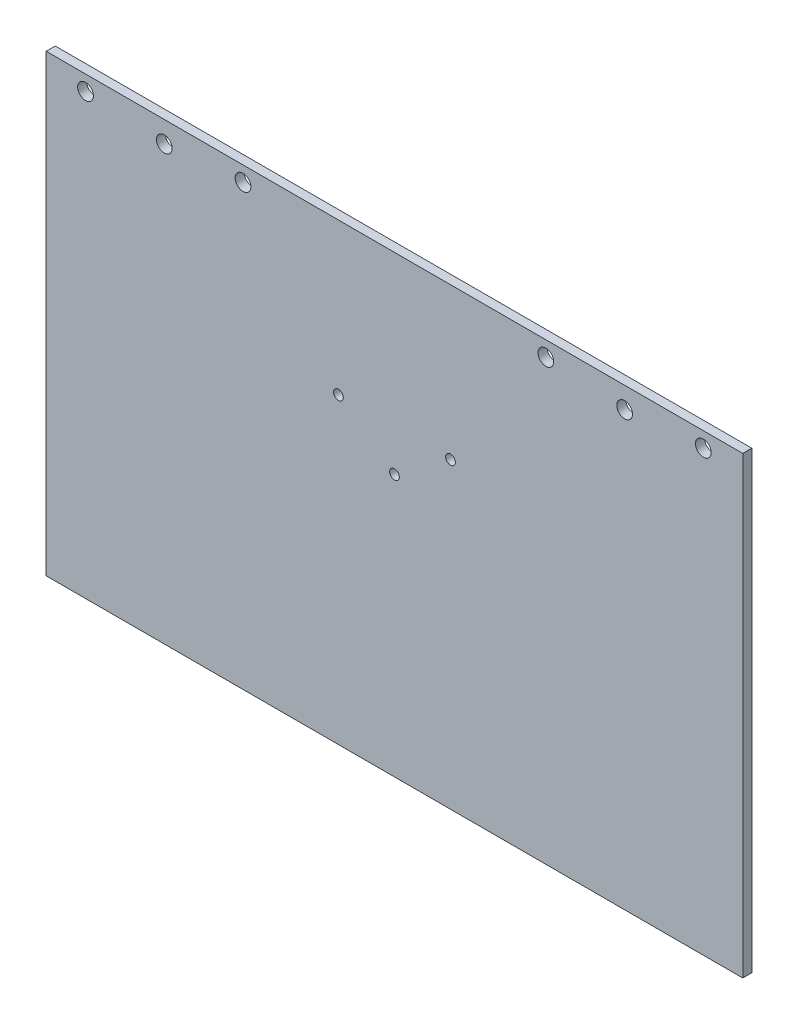
ISO-10303-21;
HEADER;
FILE_DESCRIPTION(('STEP AP214'),'2;1');
FILE_NAME('part.step','',(''),(''),'','','');
FILE_SCHEMA(('AUTOMOTIVE_DESIGN { 1 0 10303 214 1 1 1 1 }'));
ENDSEC;
DATA;
#1=APPLICATION_CONTEXT('core data for automotive mechanical design processes');
#2=APPLICATION_PROTOCOL_DEFINITION('international standard','automotive_design',2000,#1);
#3=PRODUCT_CONTEXT('',#1,'mechanical');
#4=PRODUCT('Part','Part','',(#3));
#5=PRODUCT_RELATED_PRODUCT_CATEGORY('part','',(#4));
#6=PRODUCT_DEFINITION_FORMATION('','',#4);
#7=PRODUCT_DEFINITION_CONTEXT('part definition',#1,'design');
#8=PRODUCT_DEFINITION('design','',#6,#7);
#9=PRODUCT_DEFINITION_SHAPE('','',#8);
#10=(LENGTH_UNIT() NAMED_UNIT(*) SI_UNIT(.MILLI.,.METRE.));
#11=(NAMED_UNIT(*) PLANE_ANGLE_UNIT() SI_UNIT($,.RADIAN.));
#12=(NAMED_UNIT(*) SI_UNIT($,.STERADIAN.) SOLID_ANGLE_UNIT());
#13=UNCERTAINTY_MEASURE_WITH_UNIT(LENGTH_MEASURE(1.E-05),#10,'distance_accuracy_value','');
#14=(GEOMETRIC_REPRESENTATION_CONTEXT(3) GLOBAL_UNCERTAINTY_ASSIGNED_CONTEXT((#13)) GLOBAL_UNIT_ASSIGNED_CONTEXT((#10,
#11,#12)) REPRESENTATION_CONTEXT('',''));
#15=CARTESIAN_POINT('',(0.,0.,0.));
#16=DIRECTION('',(0.,0.,1.));
#17=DIRECTION('',(1.,0.,0.));
#18=AXIS2_PLACEMENT_3D('',#15,#16,#17);
#19=CARTESIAN_POINT('',(-145.,100.,3.));
#20=DIRECTION('',(1.,0.,0.));
#21=DIRECTION('',(0.,1.,0.));
#22=AXIS2_PLACEMENT_3D('',#19,#20,#21);
#23=PLANE('',#22);
#24=DIRECTION('',(0.,-1.,0.));
#25=VECTOR('',#24,1.);
#26=CARTESIAN_POINT('',(-145.,100.,0.));
#27=LINE('',#26,#25);
#28=CARTESIAN_POINT('',(-145.,100.,0.));
#29=VERTEX_POINT('',#28);
#30=CARTESIAN_POINT('',(-145.,-50.,0.));
#31=VERTEX_POINT('',#30);
#32=EDGE_CURVE('E114',#29,#31,#27,.T.);
#33=ORIENTED_EDGE('',*,*,#32,.T.);
#34=DIRECTION('',(0.,0.,-1.));
#35=VECTOR('',#34,1.);
#36=CARTESIAN_POINT('',(-145.,-50.,3.));
#37=LINE('',#36,#35);
#38=CARTESIAN_POINT('',(-145.,-50.,3.));
#39=VERTEX_POINT('',#38);
#40=EDGE_CURVE('E13',#39,#31,#37,.T.);
#41=ORIENTED_EDGE('',*,*,#40,.F.);
#42=DIRECTION('',(0.,-1.,0.));
#43=VECTOR('',#42,1.);
#44=CARTESIAN_POINT('',(-145.,100.,3.));
#45=LINE('',#44,#43);
#46=CARTESIAN_POINT('',(-145.,100.,3.));
#47=VERTEX_POINT('',#46);
#48=EDGE_CURVE('E101',#47,#39,#45,.T.);
#49=ORIENTED_EDGE('',*,*,#48,.F.);
#50=DIRECTION('',(0.,0.,-1.));
#51=VECTOR('',#50,1.);
#52=CARTESIAN_POINT('',(-145.,100.,3.));
#53=LINE('',#52,#51);
#54=EDGE_CURVE('E110',#47,#29,#53,.T.);
#55=ORIENTED_EDGE('',*,*,#54,.T.);
#56=EDGE_LOOP('',(#33,#41,#49,#55));
#57=FACE_BOUND('',#56,.T.);
#58=ADVANCED_FACE('F48',(#57),#23,.F.);
#59=CARTESIAN_POINT('',(85.,-50.,3.));
#60=DIRECTION('',(0.,1.,0.));
#61=DIRECTION('',(-1.,0.,0.));
#62=AXIS2_PLACEMENT_3D('',#59,#60,#61);
#63=PLANE('',#62);
#64=DIRECTION('',(1.,0.,0.));
#65=VECTOR('',#64,1.);
#66=CARTESIAN_POINT('',(85.,-50.,0.));
#67=LINE('',#66,#65);
#68=CARTESIAN_POINT('',(85.,-50.,0.));
#69=VERTEX_POINT('',#68);
#70=EDGE_CURVE('E105',#31,#69,#67,.T.);
#71=ORIENTED_EDGE('',*,*,#70,.T.);
#72=DIRECTION('',(0.,0.,-1.));
#73=VECTOR('',#72,1.);
#74=CARTESIAN_POINT('',(85.,-50.,3.));
#75=LINE('',#74,#73);
#76=CARTESIAN_POINT('',(85.,-50.,3.));
#77=VERTEX_POINT('',#76);
#78=EDGE_CURVE('E57',#77,#69,#75,.T.);
#79=ORIENTED_EDGE('',*,*,#78,.F.);
#80=DIRECTION('',(1.,0.,0.));
#81=VECTOR('',#80,1.);
#82=CARTESIAN_POINT('',(85.,-50.,3.));
#83=LINE('',#82,#81);
#84=EDGE_CURVE('E96',#39,#77,#83,.T.);
#85=ORIENTED_EDGE('',*,*,#84,.F.);
#86=ORIENTED_EDGE('',*,*,#40,.T.);
#87=EDGE_LOOP('',(#71,#79,#85,#86));
#88=FACE_BOUND('',#87,.T.);
#89=ADVANCED_FACE('F104',(#88),#63,.F.);
#90=CARTESIAN_POINT('',(85.,100.,3.));
#91=DIRECTION('',(-1.,0.,0.));
#92=DIRECTION('',(0.,-1.,0.));
#93=AXIS2_PLACEMENT_3D('',#90,#91,#92);
#94=PLANE('',#93);
#95=DIRECTION('',(0.,1.,0.));
#96=VECTOR('',#95,1.);
#97=CARTESIAN_POINT('',(85.,100.,0.));
#98=LINE('',#97,#96);
#99=CARTESIAN_POINT('',(85.,100.,0.));
#100=VERTEX_POINT('',#99);
#101=EDGE_CURVE('E83',#69,#100,#98,.T.);
#102=ORIENTED_EDGE('',*,*,#101,.T.);
#103=DIRECTION('',(0.,0.,-1.));
#104=VECTOR('',#103,1.);
#105=CARTESIAN_POINT('',(85.,100.,3.));
#106=LINE('',#105,#104);
#107=CARTESIAN_POINT('',(85.,100.,3.));
#108=VERTEX_POINT('',#107);
#109=EDGE_CURVE('E106',#108,#100,#106,.T.);
#110=ORIENTED_EDGE('',*,*,#109,.F.);
#111=DIRECTION('',(0.,1.,0.));
#112=VECTOR('',#111,1.);
#113=CARTESIAN_POINT('',(85.,100.,3.));
#114=LINE('',#113,#112);
#115=EDGE_CURVE('E99',#77,#108,#114,.T.);
#116=ORIENTED_EDGE('',*,*,#115,.F.);
#117=ORIENTED_EDGE('',*,*,#78,.T.);
#118=EDGE_LOOP('',(#102,#110,#116,#117));
#119=FACE_BOUND('',#118,.T.);
#120=ADVANCED_FACE('F108',(#119),#94,.F.);
#121=CARTESIAN_POINT('',(-145.,100.,3.));
#122=DIRECTION('',(0.,-1.,0.));
#123=DIRECTION('',(0.,0.,-1.));
#124=AXIS2_PLACEMENT_3D('',#121,#122,#123);
#125=PLANE('',#124);
#126=DIRECTION('',(-1.,0.,0.));
#127=VECTOR('',#126,1.);
#128=CARTESIAN_POINT('',(-145.,100.,0.));
#129=LINE('',#128,#127);
#130=EDGE_CURVE('E89',#100,#29,#129,.T.);
#131=ORIENTED_EDGE('',*,*,#130,.T.);
#132=ORIENTED_EDGE('',*,*,#54,.F.);
#133=DIRECTION('',(-1.,0.,0.));
#134=VECTOR('',#133,1.);
#135=CARTESIAN_POINT('',(-145.,100.,3.));
#136=LINE('',#135,#134);
#137=EDGE_CURVE('E66',#108,#47,#136,.T.);
#138=ORIENTED_EDGE('',*,*,#137,.F.);
#139=ORIENTED_EDGE('',*,*,#109,.T.);
#140=EDGE_LOOP('',(#131,#132,#138,#139));
#141=FACE_BOUND('',#140,.T.);
#142=ADVANCED_FACE('F213',(#141),#125,.F.);
#143=CARTESIAN_POINT('',(0.,0.,3.));
#144=DIRECTION('',(0.,0.,-1.));
#145=DIRECTION('',(-1.,0.,0.));
#146=AXIS2_PLACEMENT_3D('',#143,#144,#145);
#147=PLANE('',#146);
#148=CARTESIAN_POINT('',(-29.9999999999284,36.4999999999856,3.));
#149=DIRECTION('',(0.,0.,1.));
#150=DIRECTION('',(1.,0.,0.));
#151=AXIS2_PLACEMENT_3D('',#148,#149,#150);
#152=CIRCLE('',#151,1.6);
#153=CARTESIAN_POINT('',(-28.3999999999285,36.4999999999856,3.));
#154=VERTEX_POINT('',#153);
#155=EDGE_CURVE('E126',#154,#154,#152,.T.);
#156=ORIENTED_EDGE('',*,*,#155,.F.);
#157=EDGE_LOOP('',(#156));
#158=FACE_BOUND('',#157,.T.);
#159=CARTESIAN_POINT('',(-11.4999999999286,49.9999999999857,3.));
#160=DIRECTION('',(0.,0.,1.));
#161=DIRECTION('',(1.,0.,0.));
#162=AXIS2_PLACEMENT_3D('',#159,#160,#161);
#163=CIRCLE('',#162,1.6);
#164=CARTESIAN_POINT('',(-9.89999999992857,49.9999999999857,3.));
#165=VERTEX_POINT('',#164);
#166=EDGE_CURVE('E328',#165,#165,#163,.T.);
#167=ORIENTED_EDGE('',*,*,#166,.F.);
#168=EDGE_LOOP('',(#167));
#169=FACE_BOUND('',#168,.T.);
#170=CARTESIAN_POINT('',(-48.4999999999285,49.9999999999854,3.));
#171=DIRECTION('',(0.,0.,1.));
#172=DIRECTION('',(1.,0.,0.));
#173=AXIS2_PLACEMENT_3D('',#170,#171,#172);
#174=CIRCLE('',#173,1.6);
#175=CARTESIAN_POINT('',(-46.8999999999285,49.9999999999854,3.));
#176=VERTEX_POINT('',#175);
#177=EDGE_CURVE('E144',#176,#176,#174,.T.);
#178=ORIENTED_EDGE('',*,*,#177,.F.);
#179=EDGE_LOOP('',(#178));
#180=FACE_BOUND('',#179,.T.);
#181=CARTESIAN_POINT('',(72.,95.,3.));
#182=DIRECTION('',(0.,0.,-1.));
#183=DIRECTION('',(-1.,0.,0.));
#184=AXIS2_PLACEMENT_3D('',#181,#182,#183);
#185=CIRCLE('',#184,2.59999999999999);
#186=CARTESIAN_POINT('',(69.4,95.,3.));
#187=VERTEX_POINT('',#186);
#188=EDGE_CURVE('E117',#187,#187,#185,.T.);
#189=ORIENTED_EDGE('',*,*,#188,.T.);
#190=EDGE_LOOP('',(#189));
#191=FACE_BOUND('',#190,.T.);
#192=CARTESIAN_POINT('',(46.,93.,3.));
#193=DIRECTION('',(0.,0.,-1.));
#194=DIRECTION('',(-1.,0.,0.));
#195=AXIS2_PLACEMENT_3D('',#192,#193,#194);
#196=CIRCLE('',#195,2.6);
#197=CARTESIAN_POINT('',(43.4,93.,3.));
#198=VERTEX_POINT('',#197);
#199=EDGE_CURVE('E169',#198,#198,#196,.T.);
#200=ORIENTED_EDGE('',*,*,#199,.T.);
#201=EDGE_LOOP('',(#200));
#202=FACE_BOUND('',#201,.T.);
#203=CARTESIAN_POINT('',(-132.,95.,3.));
#204=DIRECTION('',(0.,0.,-1.));
#205=DIRECTION('',(-1.,0.,0.));
#206=AXIS2_PLACEMENT_3D('',#203,#204,#205);
#207=CIRCLE('',#206,2.59999999999999);
#208=CARTESIAN_POINT('',(-134.6,95.,3.));
#209=VERTEX_POINT('',#208);
#210=EDGE_CURVE('E166',#209,#209,#207,.T.);
#211=ORIENTED_EDGE('',*,*,#210,.T.);
#212=EDGE_LOOP('',(#211));
#213=FACE_BOUND('',#212,.T.);
#214=CARTESIAN_POINT('',(-106.,93.,3.));
#215=DIRECTION('',(0.,0.,-1.));
#216=DIRECTION('',(-1.,0.,0.));
#217=AXIS2_PLACEMENT_3D('',#214,#215,#216);
#218=CIRCLE('',#217,2.6);
#219=CARTESIAN_POINT('',(-108.6,93.,3.));
#220=VERTEX_POINT('',#219);
#221=EDGE_CURVE('E163',#220,#220,#218,.T.);
#222=ORIENTED_EDGE('',*,*,#221,.T.);
#223=EDGE_LOOP('',(#222));
#224=FACE_BOUND('',#223,.T.);
#225=CARTESIAN_POINT('',(-80.,95.,3.));
#226=DIRECTION('',(0.,0.,-1.));
#227=DIRECTION('',(-1.,0.,0.));
#228=AXIS2_PLACEMENT_3D('',#225,#226,#227);
#229=CIRCLE('',#228,2.59999999999999);
#230=CARTESIAN_POINT('',(-82.6,95.,3.));
#231=VERTEX_POINT('',#230);
#232=EDGE_CURVE('E160',#231,#231,#229,.T.);
#233=ORIENTED_EDGE('',*,*,#232,.T.);
#234=EDGE_LOOP('',(#233));
#235=FACE_BOUND('',#234,.T.);
#236=CARTESIAN_POINT('',(20.,95.,3.));
#237=DIRECTION('',(0.,0.,-1.));
#238=DIRECTION('',(-1.,0.,0.));
#239=AXIS2_PLACEMENT_3D('',#236,#237,#238);
#240=CIRCLE('',#239,2.6);
#241=CARTESIAN_POINT('',(17.4,95.,3.));
#242=VERTEX_POINT('',#241);
#243=EDGE_CURVE('E157',#242,#242,#240,.T.);
#244=ORIENTED_EDGE('',*,*,#243,.T.);
#245=EDGE_LOOP('',(#244));
#246=FACE_BOUND('',#245,.T.);
#247=ORIENTED_EDGE('',*,*,#48,.T.);
#248=ORIENTED_EDGE('',*,*,#84,.T.);
#249=ORIENTED_EDGE('',*,*,#115,.T.);
#250=ORIENTED_EDGE('',*,*,#137,.T.);
#251=EDGE_LOOP('',(#247,#248,#249,#250));
#252=FACE_BOUND('',#251,.T.);
#253=ADVANCED_FACE('F97',(#158,#169,#180,#191,#202,#213,#224,#235,#246,#252),#147,.F.);
#254=CARTESIAN_POINT('',(0.,0.,0.));
#255=DIRECTION('',(0.,0.,-1.));
#256=DIRECTION('',(-1.,0.,0.));
#257=AXIS2_PLACEMENT_3D('',#254,#255,#256);
#258=PLANE('',#257);
#259=CARTESIAN_POINT('',(-29.9999999999284,36.4999999999856,0.));
#260=DIRECTION('',(0.,0.,-1.));
#261=DIRECTION('',(-1.,0.,0.));
#262=AXIS2_PLACEMENT_3D('',#259,#260,#261);
#263=CIRCLE('',#262,1.6);
#264=CARTESIAN_POINT('',(-31.5999999999284,36.4999999999856,0.));
#265=VERTEX_POINT('',#264);
#266=EDGE_CURVE('E51',#265,#265,#263,.T.);
#267=ORIENTED_EDGE('',*,*,#266,.F.);
#268=EDGE_LOOP('',(#267));
#269=FACE_BOUND('',#268,.T.);
#270=CARTESIAN_POINT('',(-11.4999999999286,49.9999999999857,0.));
#271=DIRECTION('',(0.,0.,-1.));
#272=DIRECTION('',(-1.,0.,0.));
#273=AXIS2_PLACEMENT_3D('',#270,#271,#272);
#274=CIRCLE('',#273,1.6);
#275=CARTESIAN_POINT('',(-13.0999999999286,49.9999999999857,0.));
#276=VERTEX_POINT('',#275);
#277=EDGE_CURVE('E125',#276,#276,#274,.T.);
#278=ORIENTED_EDGE('',*,*,#277,.F.);
#279=EDGE_LOOP('',(#278));
#280=FACE_BOUND('',#279,.T.);
#281=CARTESIAN_POINT('',(-48.4999999999285,49.9999999999854,0.));
#282=DIRECTION('',(0.,0.,-1.));
#283=DIRECTION('',(-1.,0.,0.));
#284=AXIS2_PLACEMENT_3D('',#281,#282,#283);
#285=CIRCLE('',#284,1.6);
#286=CARTESIAN_POINT('',(-50.0999999999285,49.9999999999854,0.));
#287=VERTEX_POINT('',#286);
#288=EDGE_CURVE('E123',#287,#287,#285,.T.);
#289=ORIENTED_EDGE('',*,*,#288,.F.);
#290=EDGE_LOOP('',(#289));
#291=FACE_BOUND('',#290,.T.);
#292=CARTESIAN_POINT('',(72.,95.,0.));
#293=DIRECTION('',(0.,0.,-1.));
#294=DIRECTION('',(-1.,0.,0.));
#295=AXIS2_PLACEMENT_3D('',#292,#293,#294);
#296=CIRCLE('',#295,2.59999999999999);
#297=CARTESIAN_POINT('',(69.4,95.,0.));
#298=VERTEX_POINT('',#297);
#299=EDGE_CURVE('E146',#298,#298,#296,.T.);
#300=ORIENTED_EDGE('',*,*,#299,.F.);
#301=EDGE_LOOP('',(#300));
#302=FACE_BOUND('',#301,.T.);
#303=CARTESIAN_POINT('',(46.,93.,0.));
#304=DIRECTION('',(0.,0.,-1.));
#305=DIRECTION('',(-1.,0.,0.));
#306=AXIS2_PLACEMENT_3D('',#303,#304,#305);
#307=CIRCLE('',#306,2.6);
#308=CARTESIAN_POINT('',(43.4,93.,0.));
#309=VERTEX_POINT('',#308);
#310=EDGE_CURVE('E150',#309,#309,#307,.T.);
#311=ORIENTED_EDGE('',*,*,#310,.F.);
#312=EDGE_LOOP('',(#311));
#313=FACE_BOUND('',#312,.T.);
#314=CARTESIAN_POINT('',(-132.,95.,0.));
#315=DIRECTION('',(0.,0.,-1.));
#316=DIRECTION('',(1.,0.,0.));
#317=AXIS2_PLACEMENT_3D('',#314,#315,#316);
#318=CIRCLE('',#317,2.59999999999999);
#319=CARTESIAN_POINT('',(-129.4,95.,0.));
#320=VERTEX_POINT('',#319);
#321=EDGE_CURVE('E140',#320,#320,#318,.T.);
#322=ORIENTED_EDGE('',*,*,#321,.F.);
#323=EDGE_LOOP('',(#322));
#324=FACE_BOUND('',#323,.T.);
#325=CARTESIAN_POINT('',(-106.,93.,0.));
#326=DIRECTION('',(0.,0.,-1.));
#327=DIRECTION('',(1.,0.,0.));
#328=AXIS2_PLACEMENT_3D('',#325,#326,#327);
#329=CIRCLE('',#328,2.6);
#330=CARTESIAN_POINT('',(-103.4,93.,0.));
#331=VERTEX_POINT('',#330);
#332=EDGE_CURVE('E135',#331,#331,#329,.T.);
#333=ORIENTED_EDGE('',*,*,#332,.F.);
#334=EDGE_LOOP('',(#333));
#335=FACE_BOUND('',#334,.T.);
#336=CARTESIAN_POINT('',(-80.,95.,0.));
#337=DIRECTION('',(0.,0.,-1.));
#338=DIRECTION('',(1.,0.,0.));
#339=AXIS2_PLACEMENT_3D('',#336,#337,#338);
#340=CIRCLE('',#339,2.59999999999999);
#341=CARTESIAN_POINT('',(-77.4,95.,0.));
#342=VERTEX_POINT('',#341);
#343=EDGE_CURVE('E131',#342,#342,#340,.T.);
#344=ORIENTED_EDGE('',*,*,#343,.F.);
#345=EDGE_LOOP('',(#344));
#346=FACE_BOUND('',#345,.T.);
#347=CARTESIAN_POINT('',(20.,95.,0.));
#348=DIRECTION('',(0.,0.,-1.));
#349=DIRECTION('',(-1.,0.,0.));
#350=AXIS2_PLACEMENT_3D('',#347,#348,#349);
#351=CIRCLE('',#350,2.6);
#352=CARTESIAN_POINT('',(17.4,95.,0.));
#353=VERTEX_POINT('',#352);
#354=EDGE_CURVE('E149',#353,#353,#351,.T.);
#355=ORIENTED_EDGE('',*,*,#354,.F.);
#356=EDGE_LOOP('',(#355));
#357=FACE_BOUND('',#356,.T.);
#358=ORIENTED_EDGE('',*,*,#32,.F.);
#359=ORIENTED_EDGE('',*,*,#130,.F.);
#360=ORIENTED_EDGE('',*,*,#101,.F.);
#361=ORIENTED_EDGE('',*,*,#70,.F.);
#362=EDGE_LOOP('',(#358,#359,#360,#361));
#363=FACE_BOUND('',#362,.T.);
#364=ADVANCED_FACE('F201',(#269,#280,#291,#302,#313,#324,#335,#346,#357,#363),#258,.T.);
#365=CARTESIAN_POINT('',(20.,95.,10.));
#366=DIRECTION('',(0.,0.,-1.));
#367=DIRECTION('',(-1.,0.,0.));
#368=AXIS2_PLACEMENT_3D('',#365,#366,#367);
#369=CYLINDRICAL_SURFACE('',#368,2.6);
#370=ORIENTED_EDGE('',*,*,#354,.T.);
#371=EDGE_LOOP('',(#370));
#372=FACE_BOUND('',#371,.T.);
#373=ORIENTED_EDGE('',*,*,#243,.F.);
#374=EDGE_LOOP('',(#373));
#375=FACE_BOUND('',#374,.T.);
#376=ADVANCED_FACE('F203',(#372,#375),#369,.F.);
#377=CARTESIAN_POINT('',(-80.,95.,10.));
#378=DIRECTION('',(0.,0.,-1.));
#379=DIRECTION('',(-1.,0.,0.));
#380=AXIS2_PLACEMENT_3D('',#377,#378,#379);
#381=CYLINDRICAL_SURFACE('',#380,2.59999999999999);
#382=ORIENTED_EDGE('',*,*,#343,.T.);
#383=EDGE_LOOP('',(#382));
#384=FACE_BOUND('',#383,.T.);
#385=ORIENTED_EDGE('',*,*,#232,.F.);
#386=EDGE_LOOP('',(#385));
#387=FACE_BOUND('',#386,.T.);
#388=ADVANCED_FACE('F210',(#384,#387),#381,.F.);
#389=CARTESIAN_POINT('',(-106.,93.,10.));
#390=DIRECTION('',(0.,0.,-1.));
#391=DIRECTION('',(-1.,0.,0.));
#392=AXIS2_PLACEMENT_3D('',#389,#390,#391);
#393=CYLINDRICAL_SURFACE('',#392,2.6);
#394=ORIENTED_EDGE('',*,*,#332,.T.);
#395=EDGE_LOOP('',(#394));
#396=FACE_BOUND('',#395,.T.);
#397=ORIENTED_EDGE('',*,*,#221,.F.);
#398=EDGE_LOOP('',(#397));
#399=FACE_BOUND('',#398,.T.);
#400=ADVANCED_FACE('F271',(#396,#399),#393,.F.);
#401=CARTESIAN_POINT('',(-132.,95.,10.));
#402=DIRECTION('',(0.,0.,-1.));
#403=DIRECTION('',(-1.,0.,0.));
#404=AXIS2_PLACEMENT_3D('',#401,#402,#403);
#405=CYLINDRICAL_SURFACE('',#404,2.59999999999999);
#406=ORIENTED_EDGE('',*,*,#321,.T.);
#407=EDGE_LOOP('',(#406));
#408=FACE_BOUND('',#407,.T.);
#409=ORIENTED_EDGE('',*,*,#210,.F.);
#410=EDGE_LOOP('',(#409));
#411=FACE_BOUND('',#410,.T.);
#412=ADVANCED_FACE('F190',(#408,#411),#405,.F.);
#413=CARTESIAN_POINT('',(46.,93.,10.));
#414=DIRECTION('',(0.,0.,-1.));
#415=DIRECTION('',(-1.,0.,0.));
#416=AXIS2_PLACEMENT_3D('',#413,#414,#415);
#417=CYLINDRICAL_SURFACE('',#416,2.6);
#418=ORIENTED_EDGE('',*,*,#310,.T.);
#419=EDGE_LOOP('',(#418));
#420=FACE_BOUND('',#419,.T.);
#421=ORIENTED_EDGE('',*,*,#199,.F.);
#422=EDGE_LOOP('',(#421));
#423=FACE_BOUND('',#422,.T.);
#424=ADVANCED_FACE('F180',(#420,#423),#417,.F.);
#425=CARTESIAN_POINT('',(72.,95.,10.));
#426=DIRECTION('',(0.,0.,-1.));
#427=DIRECTION('',(-1.,0.,0.));
#428=AXIS2_PLACEMENT_3D('',#425,#426,#427);
#429=CYLINDRICAL_SURFACE('',#428,2.59999999999999);
#430=ORIENTED_EDGE('',*,*,#299,.T.);
#431=EDGE_LOOP('',(#430));
#432=FACE_BOUND('',#431,.T.);
#433=ORIENTED_EDGE('',*,*,#188,.F.);
#434=EDGE_LOOP('',(#433));
#435=FACE_BOUND('',#434,.T.);
#436=ADVANCED_FACE('F177',(#432,#435),#429,.F.);
#437=CARTESIAN_POINT('',(-48.4999999999285,49.9999999999854,-7.));
#438=DIRECTION('',(0.,0.,1.));
#439=DIRECTION('',(1.,0.,0.));
#440=AXIS2_PLACEMENT_3D('',#437,#438,#439);
#441=CYLINDRICAL_SURFACE('',#440,1.6);
#442=ORIENTED_EDGE('',*,*,#288,.T.);
#443=EDGE_LOOP('',(#442));
#444=FACE_BOUND('',#443,.T.);
#445=ORIENTED_EDGE('',*,*,#177,.T.);
#446=EDGE_LOOP('',(#445));
#447=FACE_BOUND('',#446,.T.);
#448=ADVANCED_FACE('F179',(#444,#447),#441,.F.);
#449=CARTESIAN_POINT('',(-11.4999999999286,49.9999999999857,-7.));
#450=DIRECTION('',(0.,0.,1.));
#451=DIRECTION('',(1.,0.,0.));
#452=AXIS2_PLACEMENT_3D('',#449,#450,#451);
#453=CYLINDRICAL_SURFACE('',#452,1.6);
#454=ORIENTED_EDGE('',*,*,#277,.T.);
#455=EDGE_LOOP('',(#454));
#456=FACE_BOUND('',#455,.T.);
#457=ORIENTED_EDGE('',*,*,#166,.T.);
#458=EDGE_LOOP('',(#457));
#459=FACE_BOUND('',#458,.T.);
#460=ADVANCED_FACE('F187',(#456,#459),#453,.F.);
#461=CARTESIAN_POINT('',(-29.9999999999284,36.4999999999856,-7.));
#462=DIRECTION('',(0.,0.,1.));
#463=DIRECTION('',(1.,0.,0.));
#464=AXIS2_PLACEMENT_3D('',#461,#462,#463);
#465=CYLINDRICAL_SURFACE('',#464,1.6);
#466=ORIENTED_EDGE('',*,*,#266,.T.);
#467=EDGE_LOOP('',(#466));
#468=FACE_BOUND('',#467,.T.);
#469=ORIENTED_EDGE('',*,*,#155,.T.);
#470=EDGE_LOOP('',(#469));
#471=FACE_BOUND('',#470,.T.);
#472=ADVANCED_FACE('F257',(#468,#471),#465,.F.);
#473=CLOSED_SHELL('',(#58,#89,#120,#142,#253,#364,#376,#388,#400,#412,#424,#436,#448,#460,#472));
#474=MANIFOLD_SOLID_BREP('B2',#473);
#475=ADVANCED_BREP_SHAPE_REPRESENTATION('',(#18,#474),#14);
#476=SHAPE_DEFINITION_REPRESENTATION(#9,#475);
ENDSEC;
END-ISO-10303-21;
